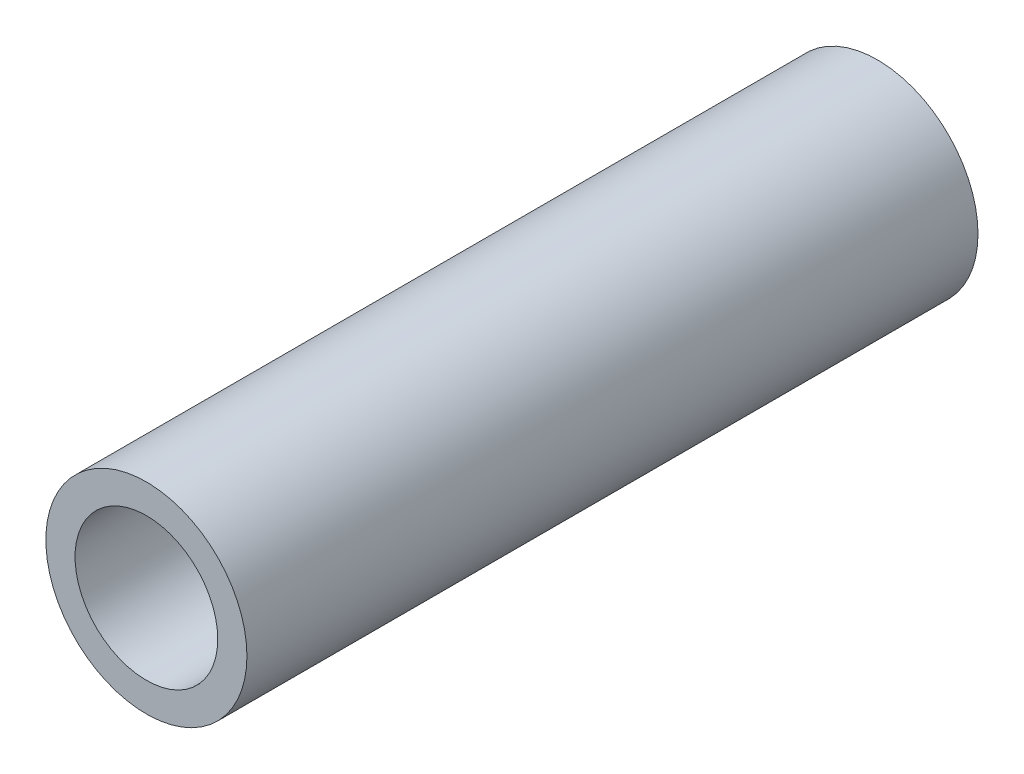
ISO-10303-21;
HEADER;
FILE_DESCRIPTION(('STEP AP214'),'2;1');
FILE_NAME('part.step','',(''),(''),'','','');
FILE_SCHEMA(('AUTOMOTIVE_DESIGN { 1 0 10303 214 1 1 1 1 }'));
ENDSEC;
DATA;
#1=APPLICATION_CONTEXT('core data for automotive mechanical design processes');
#2=APPLICATION_PROTOCOL_DEFINITION('international standard','automotive_design',2000,#1);
#3=PRODUCT_CONTEXT('',#1,'mechanical');
#4=PRODUCT('Part','Part','',(#3));
#5=PRODUCT_RELATED_PRODUCT_CATEGORY('part','',(#4));
#6=PRODUCT_DEFINITION_FORMATION('','',#4);
#7=PRODUCT_DEFINITION_CONTEXT('part definition',#1,'design');
#8=PRODUCT_DEFINITION('design','',#6,#7);
#9=PRODUCT_DEFINITION_SHAPE('','',#8);
#10=(LENGTH_UNIT() NAMED_UNIT(*) SI_UNIT(.MILLI.,.METRE.));
#11=(NAMED_UNIT(*) PLANE_ANGLE_UNIT() SI_UNIT($,.RADIAN.));
#12=(NAMED_UNIT(*) SI_UNIT($,.STERADIAN.) SOLID_ANGLE_UNIT());
#13=UNCERTAINTY_MEASURE_WITH_UNIT(LENGTH_MEASURE(1.E-05),#10,'distance_accuracy_value','');
#14=(GEOMETRIC_REPRESENTATION_CONTEXT(3) GLOBAL_UNCERTAINTY_ASSIGNED_CONTEXT((#13)) GLOBAL_UNIT_ASSIGNED_CONTEXT((#10,
#11,#12)) REPRESENTATION_CONTEXT('',''));
#15=CARTESIAN_POINT('',(0.,0.,0.));
#16=DIRECTION('',(0.,0.,1.));
#17=DIRECTION('',(1.,0.,0.));
#18=AXIS2_PLACEMENT_3D('',#15,#16,#17);
#19=CARTESIAN_POINT('',(0.,0.,28.6258));
#20=DIRECTION('',(0.,0.,1.));
#21=DIRECTION('',(1.,0.,0.));
#22=AXIS2_PLACEMENT_3D('',#19,#20,#21);
#23=PLANE('',#22);
#24=CARTESIAN_POINT('',(0.,0.,28.6258));
#25=DIRECTION('',(0.,0.,1.));
#26=DIRECTION('',(1.,0.,0.));
#27=AXIS2_PLACEMENT_3D('',#24,#25,#26);
#28=CIRCLE('',#27,3.937);
#29=CARTESIAN_POINT('',(3.937,0.,28.6258));
#30=VERTEX_POINT('',#29);
#31=EDGE_CURVE('E10',#30,#30,#28,.T.);
#32=ORIENTED_EDGE('',*,*,#31,.T.);
#33=EDGE_LOOP('',(#32));
#34=FACE_BOUND('',#33,.T.);
#35=CARTESIAN_POINT('',(0.,0.,28.6258));
#36=DIRECTION('',(0.,0.,1.));
#37=DIRECTION('',(1.,0.,0.));
#38=AXIS2_PLACEMENT_3D('',#35,#36,#37);
#39=CIRCLE('',#38,2.794);
#40=CARTESIAN_POINT('',(2.794,0.,28.6258));
#41=VERTEX_POINT('',#40);
#42=EDGE_CURVE('E50',#41,#41,#39,.T.);
#43=ORIENTED_EDGE('',*,*,#42,.F.);
#44=EDGE_LOOP('',(#43));
#45=FACE_BOUND('',#44,.T.);
#46=ADVANCED_FACE('F37',(#34,#45),#23,.T.);
#47=CARTESIAN_POINT('',(0.,0.,0.));
#48=DIRECTION('',(0.,0.,1.));
#49=DIRECTION('',(1.,0.,0.));
#50=AXIS2_PLACEMENT_3D('',#47,#48,#49);
#51=PLANE('',#50);
#52=CARTESIAN_POINT('',(0.,0.,0.));
#53=DIRECTION('',(0.,0.,1.));
#54=DIRECTION('',(1.,0.,0.));
#55=AXIS2_PLACEMENT_3D('',#52,#53,#54);
#56=CIRCLE('',#55,3.937);
#57=CARTESIAN_POINT('',(3.937,0.,0.));
#58=VERTEX_POINT('',#57);
#59=EDGE_CURVE('E41',#58,#58,#56,.T.);
#60=ORIENTED_EDGE('',*,*,#59,.F.);
#61=EDGE_LOOP('',(#60));
#62=FACE_BOUND('',#61,.T.);
#63=CARTESIAN_POINT('',(0.,0.,0.));
#64=DIRECTION('',(0.,0.,1.));
#65=DIRECTION('',(1.,0.,0.));
#66=AXIS2_PLACEMENT_3D('',#63,#64,#65);
#67=CIRCLE('',#66,2.794);
#68=CARTESIAN_POINT('',(2.794,0.,0.));
#69=VERTEX_POINT('',#68);
#70=EDGE_CURVE('E52',#69,#69,#67,.T.);
#71=ORIENTED_EDGE('',*,*,#70,.T.);
#72=EDGE_LOOP('',(#71));
#73=FACE_BOUND('',#72,.T.);
#74=ADVANCED_FACE('F64',(#62,#73),#51,.F.);
#75=CARTESIAN_POINT('',(0.,0.,28.6258));
#76=DIRECTION('',(0.,0.,-1.));
#77=DIRECTION('',(-1.,0.,0.));
#78=AXIS2_PLACEMENT_3D('',#75,#76,#77);
#79=CYLINDRICAL_SURFACE('',#78,3.937);
#80=ORIENTED_EDGE('',*,*,#31,.F.);
#81=EDGE_LOOP('',(#80));
#82=FACE_BOUND('',#81,.T.);
#83=ORIENTED_EDGE('',*,*,#59,.T.);
#84=EDGE_LOOP('',(#83));
#85=FACE_BOUND('',#84,.T.);
#86=ADVANCED_FACE('F39',(#82,#85),#79,.T.);
#87=CARTESIAN_POINT('',(0.,0.,28.6258));
#88=DIRECTION('',(0.,0.,-1.));
#89=DIRECTION('',(-1.,0.,0.));
#90=AXIS2_PLACEMENT_3D('',#87,#88,#89);
#91=CYLINDRICAL_SURFACE('',#90,2.794);
#92=ORIENTED_EDGE('',*,*,#42,.T.);
#93=EDGE_LOOP('',(#92));
#94=FACE_BOUND('',#93,.T.);
#95=ORIENTED_EDGE('',*,*,#70,.F.);
#96=EDGE_LOOP('',(#95));
#97=FACE_BOUND('',#96,.T.);
#98=ADVANCED_FACE('F60',(#94,#97),#91,.F.);
#99=CLOSED_SHELL('',(#46,#74,#86,#98));
#100=MANIFOLD_SOLID_BREP('B2',#99);
#101=ADVANCED_BREP_SHAPE_REPRESENTATION('',(#18,#100),#14);
#102=SHAPE_DEFINITION_REPRESENTATION(#9,#101);
ENDSEC;
END-ISO-10303-21;
